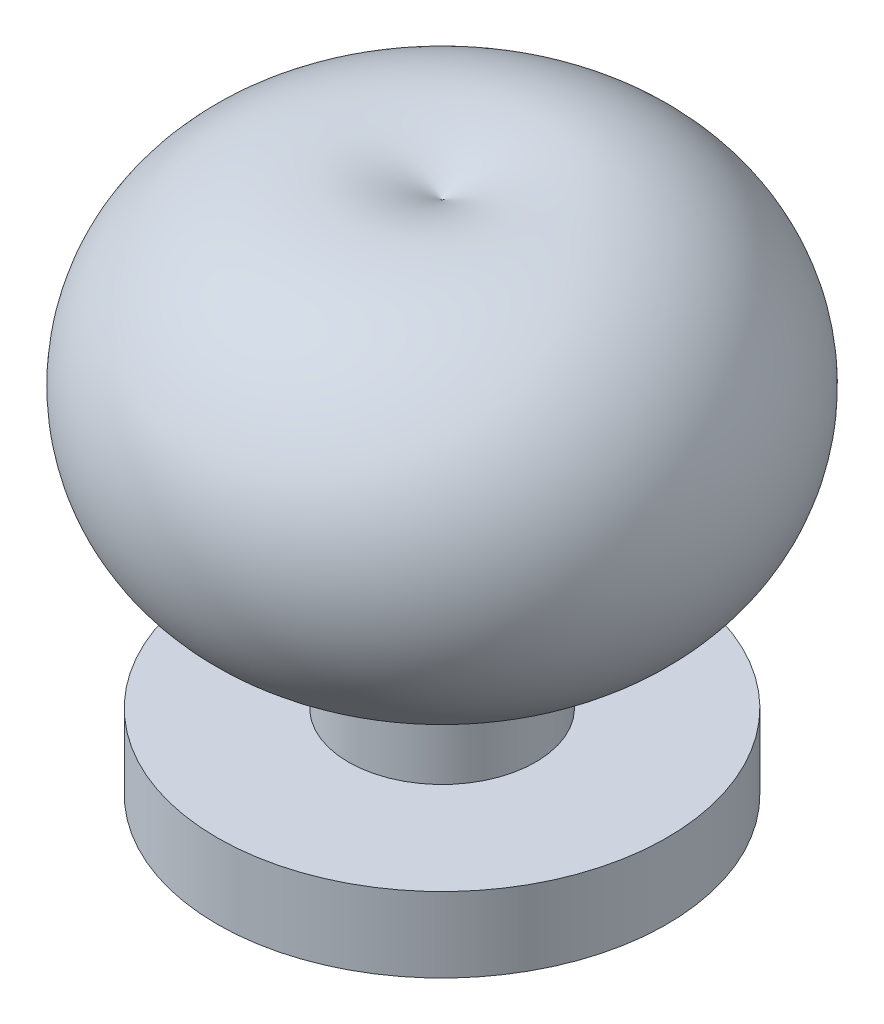
ISO-10303-21;
HEADER;
FILE_DESCRIPTION(('STEP AP214'),'2;1');
FILE_NAME('part.step','',(''),(''),'','','');
FILE_SCHEMA(('AUTOMOTIVE_DESIGN { 1 0 10303 214 1 1 1 1 }'));
ENDSEC;
DATA;
#1=APPLICATION_CONTEXT('core data for automotive mechanical design processes');
#2=APPLICATION_PROTOCOL_DEFINITION('international standard','automotive_design',2000,#1);
#3=PRODUCT_CONTEXT('',#1,'mechanical');
#4=PRODUCT('Part','Part','',(#3));
#5=PRODUCT_RELATED_PRODUCT_CATEGORY('part','',(#4));
#6=PRODUCT_DEFINITION_FORMATION('','',#4);
#7=PRODUCT_DEFINITION_CONTEXT('part definition',#1,'design');
#8=PRODUCT_DEFINITION('design','',#6,#7);
#9=PRODUCT_DEFINITION_SHAPE('','',#8);
#10=(LENGTH_UNIT() NAMED_UNIT(*) SI_UNIT(.MILLI.,.METRE.));
#11=(NAMED_UNIT(*) PLANE_ANGLE_UNIT() SI_UNIT($,.RADIAN.));
#12=(NAMED_UNIT(*) SI_UNIT($,.STERADIAN.) SOLID_ANGLE_UNIT());
#13=UNCERTAINTY_MEASURE_WITH_UNIT(LENGTH_MEASURE(1.E-05),#10,'distance_accuracy_value','');
#14=(GEOMETRIC_REPRESENTATION_CONTEXT(3) GLOBAL_UNCERTAINTY_ASSIGNED_CONTEXT((#13)) GLOBAL_UNIT_ASSIGNED_CONTEXT((#10,
#11,#12)) REPRESENTATION_CONTEXT('',''));
#15=CARTESIAN_POINT('',(0.,0.,0.));
#16=DIRECTION('',(0.,0.,1.));
#17=DIRECTION('',(1.,0.,0.));
#18=AXIS2_PLACEMENT_3D('',#15,#16,#17);
#19=CARTESIAN_POINT('',(0.,0.,0.));
#20=DIRECTION('',(0.,1.,0.));
#21=DIRECTION('',(0.,0.,1.));
#22=AXIS2_PLACEMENT_3D('',#19,#20,#21);
#23=PLANE('',#22);
#24=CARTESIAN_POINT('',(0.,0.,0.));
#25=DIRECTION('',(0.,1.,0.));
#26=DIRECTION('',(0.,0.,1.));
#27=AXIS2_PLACEMENT_3D('',#24,#25,#26);
#28=CIRCLE('',#27,6.);
#29=CARTESIAN_POINT('',(0.,0.,6.));
#30=VERTEX_POINT('',#29);
#31=EDGE_CURVE('E11',#30,#30,#28,.T.);
#32=ORIENTED_EDGE('',*,*,#31,.F.);
#33=EDGE_LOOP('',(#32));
#34=FACE_BOUND('',#33,.T.);
#35=ADVANCED_FACE('F32',(#34),#23,.F.);
#36=CARTESIAN_POINT('',(0.,13.75,0.));
#37=DIRECTION('',(0.,1.,0.));
#38=DIRECTION('',(0.,0.,1.));
#39=AXIS2_PLACEMENT_3D('',#36,#37,#38);
#40=CYLINDRICAL_SURFACE('',#39,6.);
#41=CARTESIAN_POINT('',(0.,2.,0.));
#42=DIRECTION('',(0.,1.,0.));
#43=DIRECTION('',(0.,0.,1.));
#44=AXIS2_PLACEMENT_3D('',#41,#42,#43);
#45=CIRCLE('',#44,6.);
#46=CARTESIAN_POINT('',(0.,2.,6.));
#47=VERTEX_POINT('',#46);
#48=EDGE_CURVE('E38',#47,#47,#45,.T.);
#49=ORIENTED_EDGE('',*,*,#48,.F.);
#50=EDGE_LOOP('',(#49));
#51=FACE_BOUND('',#50,.T.);
#52=ORIENTED_EDGE('',*,*,#31,.T.);
#53=EDGE_LOOP('',(#52));
#54=FACE_BOUND('',#53,.T.);
#55=ADVANCED_FACE('F59',(#51,#54),#40,.T.);
#56=CARTESIAN_POINT('',(0.,2.,-6.));
#57=DIRECTION('',(0.,-1.,0.));
#58=DIRECTION('',(0.,0.,-1.));
#59=AXIS2_PLACEMENT_3D('',#56,#57,#58);
#60=PLANE('',#59);
#61=CARTESIAN_POINT('',(0.,2.,0.));
#62=DIRECTION('',(0.,1.,0.));
#63=DIRECTION('',(0.,0.,1.));
#64=AXIS2_PLACEMENT_3D('',#61,#62,#63);
#65=CIRCLE('',#64,2.5);
#66=CARTESIAN_POINT('',(0.,2.,2.5));
#67=VERTEX_POINT('',#66);
#68=EDGE_CURVE('E50',#67,#67,#65,.T.);
#69=ORIENTED_EDGE('',*,*,#68,.F.);
#70=EDGE_LOOP('',(#69));
#71=FACE_BOUND('',#70,.T.);
#72=ORIENTED_EDGE('',*,*,#48,.T.);
#73=EDGE_LOOP('',(#72));
#74=FACE_BOUND('',#73,.T.);
#75=ADVANCED_FACE('F57',(#71,#74),#60,.F.);
#76=CARTESIAN_POINT('',(0.,13.75,0.));
#77=DIRECTION('',(0.,1.,0.));
#78=DIRECTION('',(0.,0.,1.));
#79=AXIS2_PLACEMENT_3D('',#76,#77,#78);
#80=CYLINDRICAL_SURFACE('',#79,2.5);
#81=CARTESIAN_POINT('',(0.,4.5,0.));
#82=DIRECTION('',(0.,1.,0.));
#83=DIRECTION('',(0.,0.,1.));
#84=AXIS2_PLACEMENT_3D('',#81,#82,#83);
#85=CIRCLE('',#84,2.5);
#86=CARTESIAN_POINT('',(0.,4.5,2.5));
#87=VERTEX_POINT('',#86);
#88=EDGE_CURVE('E48',#87,#87,#85,.T.);
#89=ORIENTED_EDGE('',*,*,#88,.F.);
#90=EDGE_LOOP('',(#89));
#91=FACE_BOUND('',#90,.T.);
#92=ORIENTED_EDGE('',*,*,#68,.T.);
#93=EDGE_LOOP('',(#92));
#94=FACE_BOUND('',#93,.T.);
#95=ADVANCED_FACE('F44',(#91,#94),#80,.T.);
#96=CARTESIAN_POINT('',(0.,9.46283783783784,2.5));
#97=DIRECTION('',(-1.,0.,0.));
#98=DIRECTION('',(0.,0.,1.));
#99=AXIS2_PLACEMENT_3D('',#96,#97,#98);
#100=CIRCLE('',#99,4.96283783783784);
#101=TRIMMED_CURVE('',#100,(PARAMETER_VALUE(-2.09872377404631)),
(PARAMETER_VALUE(2.09872377404631)),.T.,.PARAMETER.);
#102=CARTESIAN_POINT('',(0.,9.46283783783784,0.));
#103=DIRECTION('',(0.,1.,0.));
#104=AXIS1_PLACEMENT('',#102,#103);
#105=SURFACE_OF_REVOLUTION('',#101,#104);
#106=CARTESIAN_POINT('',(0.,13.75,0.));
#107=VERTEX_POINT('',#106);
#108=VERTEX_LOOP('',#107);
#109=FACE_BOUND('',#108,.T.);
#110=ORIENTED_EDGE('',*,*,#88,.T.);
#111=EDGE_LOOP('',(#110));
#112=FACE_BOUND('',#111,.T.);
#113=ADVANCED_FACE('F41',(#109,#112),#105,.T.);
#114=CLOSED_SHELL('',(#35,#55,#75,#95,#113));
#115=MANIFOLD_SOLID_BREP('B2',#114);
#116=ADVANCED_BREP_SHAPE_REPRESENTATION('',(#18,#115),#14);
#117=SHAPE_DEFINITION_REPRESENTATION(#9,#116);
ENDSEC;
END-ISO-10303-21;
